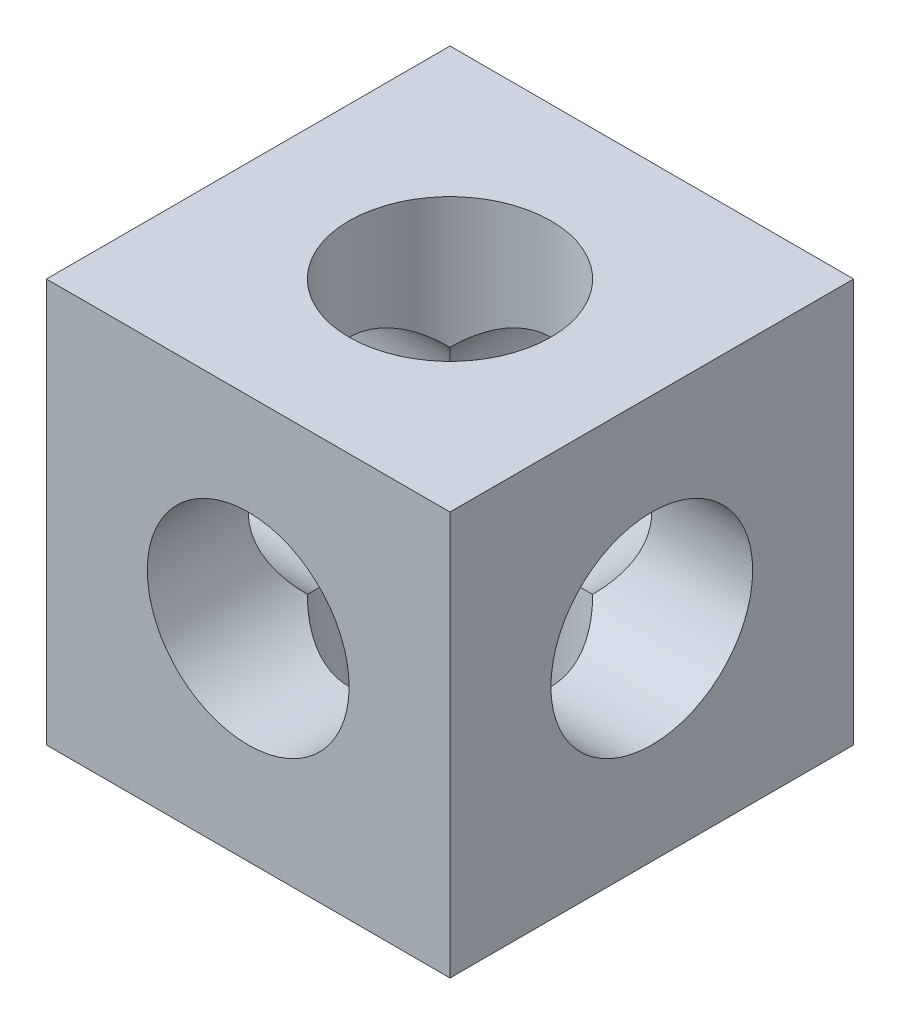
ISO-10303-21;
HEADER;
FILE_DESCRIPTION(('STEP AP214'),'2;1');
FILE_NAME('part.step','',(''),(''),'','','');
FILE_SCHEMA(('AUTOMOTIVE_DESIGN { 1 0 10303 214 1 1 1 1 }'));
ENDSEC;
DATA;
#1=APPLICATION_CONTEXT('core data for automotive mechanical design processes');
#2=APPLICATION_PROTOCOL_DEFINITION('international standard','automotive_design',2000,#1);
#3=PRODUCT_CONTEXT('',#1,'mechanical');
#4=PRODUCT('Part','Part','',(#3));
#5=PRODUCT_RELATED_PRODUCT_CATEGORY('part','',(#4));
#6=PRODUCT_DEFINITION_FORMATION('','',#4);
#7=PRODUCT_DEFINITION_CONTEXT('part definition',#1,'design');
#8=PRODUCT_DEFINITION('design','',#6,#7);
#9=PRODUCT_DEFINITION_SHAPE('','',#8);
#10=(LENGTH_UNIT() NAMED_UNIT(*) SI_UNIT(.MILLI.,.METRE.));
#11=(NAMED_UNIT(*) PLANE_ANGLE_UNIT() SI_UNIT($,.RADIAN.));
#12=(NAMED_UNIT(*) SI_UNIT($,.STERADIAN.) SOLID_ANGLE_UNIT());
#13=UNCERTAINTY_MEASURE_WITH_UNIT(LENGTH_MEASURE(1.E-05),#10,'distance_accuracy_value','');
#14=(GEOMETRIC_REPRESENTATION_CONTEXT(3) GLOBAL_UNCERTAINTY_ASSIGNED_CONTEXT((#13)) GLOBAL_UNIT_ASSIGNED_CONTEXT((#10,
#11,#12)) REPRESENTATION_CONTEXT('',''));
#15=CARTESIAN_POINT('',(0.,0.,0.));
#16=DIRECTION('',(0.,0.,1.));
#17=DIRECTION('',(1.,0.,0.));
#18=AXIS2_PLACEMENT_3D('',#15,#16,#17);
#19=CARTESIAN_POINT('',(25.4,25.4,0.));
#20=DIRECTION('',(0.,0.,1.));
#21=DIRECTION('',(1.,0.,0.));
#22=AXIS2_PLACEMENT_3D('',#19,#20,#21);
#23=CYLINDRICAL_SURFACE('',#22,12.7);
#24=CARTESIAN_POINT('',(25.4,25.4,50.8));
#25=DIRECTION('',(0.,0.,1.));
#26=DIRECTION('',(1.,0.,0.));
#27=AXIS2_PLACEMENT_3D('',#24,#25,#26);
#28=CIRCLE('',#27,12.7);
#29=CARTESIAN_POINT('',(38.1,25.4,50.8));
#30=VERTEX_POINT('',#29);
#31=EDGE_CURVE('E150',#30,#30,#28,.T.);
#32=ORIENTED_EDGE('',*,*,#31,.T.);
#33=EDGE_LOOP('',(#32));
#34=FACE_BOUND('',#33,.T.);
#35=CARTESIAN_POINT('',(25.4,25.4,25.4));
#36=DIRECTION('',(0.,-0.707106781186547,0.707106781186547));
#37=DIRECTION('',(0.,0.707106781186547,0.707106781186547));
#38=AXIS2_PLACEMENT_3D('',#35,#36,#37);
#39=ELLIPSE('',#38,17.9605122421383,12.7);
#40=CARTESIAN_POINT('',(16.4197438789308,34.3802561210692,34.3802561210692));
#41=VERTEX_POINT('',#40);
#42=CARTESIAN_POINT('',(34.3802561210692,34.3802561210692,34.3802561210692));
#43=VERTEX_POINT('',#42);
#44=EDGE_CURVE('E107',#41,#43,#39,.F.);
#45=ORIENTED_EDGE('',*,*,#44,.T.);
#46=CARTESIAN_POINT('',(25.4,25.4,25.4));
#47=DIRECTION('',(-0.707106781186547,0.,0.707106781186547));
#48=DIRECTION('',(0.707106781186547,0.,0.707106781186547));
#49=AXIS2_PLACEMENT_3D('',#46,#47,#48);
#50=ELLIPSE('',#49,17.9605122421383,12.7);
#51=CARTESIAN_POINT('',(34.3802561210692,16.4197438789308,34.3802561210692));
#52=VERTEX_POINT('',#51);
#53=EDGE_CURVE('E96',#43,#52,#50,.F.);
#54=ORIENTED_EDGE('',*,*,#53,.T.);
#55=CARTESIAN_POINT('',(25.4,25.4,25.4));
#56=DIRECTION('',(0.,0.707106781186547,0.707106781186547));
#57=DIRECTION('',(0.,-0.707106781186547,0.707106781186547));
#58=AXIS2_PLACEMENT_3D('',#55,#56,#57);
#59=ELLIPSE('',#58,17.9605122421383,12.7);
#60=CARTESIAN_POINT('',(16.4197438789308,16.4197438789308,34.3802561210692));
#61=VERTEX_POINT('',#60);
#62=EDGE_CURVE('E102',#52,#61,#59,.F.);
#63=ORIENTED_EDGE('',*,*,#62,.T.);
#64=CARTESIAN_POINT('',(25.4,25.4,25.4));
#65=DIRECTION('',(0.707106781186547,0.,0.707106781186547));
#66=DIRECTION('',(-0.707106781186547,0.,0.707106781186547));
#67=AXIS2_PLACEMENT_3D('',#64,#65,#66);
#68=ELLIPSE('',#67,17.9605122421383,12.7);
#69=EDGE_CURVE('E48',#61,#41,#68,.F.);
#70=ORIENTED_EDGE('',*,*,#69,.T.);
#71=EDGE_LOOP('',(#45,#54,#63,#70));
#72=FACE_BOUND('',#71,.T.);
#73=ADVANCED_FACE('F33',(#34,#72),#23,.F.);
#74=CARTESIAN_POINT('',(0.,0.,50.8));
#75=DIRECTION('',(1.,0.,0.));
#76=DIRECTION('',(0.,0.,-1.));
#77=AXIS2_PLACEMENT_3D('',#74,#75,#76);
#78=PLANE('',#77);
#79=CARTESIAN_POINT('',(0.,25.4,25.4));
#80=DIRECTION('',(-1.,0.,0.));
#81=DIRECTION('',(0.,0.,1.));
#82=AXIS2_PLACEMENT_3D('',#79,#80,#81);
#83=CIRCLE('',#82,12.7);
#84=CARTESIAN_POINT('',(0.,25.4,38.1));
#85=VERTEX_POINT('',#84);
#86=EDGE_CURVE('E171',#85,#85,#83,.T.);
#87=ORIENTED_EDGE('',*,*,#86,.F.);
#88=EDGE_LOOP('',(#87));
#89=FACE_BOUND('',#88,.T.);
#90=DIRECTION('',(0.,-1.,0.));
#91=VECTOR('',#90,1.);
#92=CARTESIAN_POINT('',(0.,0.,0.));
#93=LINE('',#92,#91);
#94=CARTESIAN_POINT('',(0.,50.8,0.));
#95=VERTEX_POINT('',#94);
#96=CARTESIAN_POINT('',(0.,0.,0.));
#97=VERTEX_POINT('',#96);
#98=EDGE_CURVE('E139',#95,#97,#93,.T.);
#99=ORIENTED_EDGE('',*,*,#98,.T.);
#100=DIRECTION('',(0.,0.,-1.));
#101=VECTOR('',#100,1.);
#102=CARTESIAN_POINT('',(0.,0.,50.8));
#103=LINE('',#102,#101);
#104=CARTESIAN_POINT('',(0.,0.,50.8));
#105=VERTEX_POINT('',#104);
#106=EDGE_CURVE('E119',#105,#97,#103,.T.);
#107=ORIENTED_EDGE('',*,*,#106,.F.);
#108=DIRECTION('',(0.,-1.,0.));
#109=VECTOR('',#108,1.);
#110=CARTESIAN_POINT('',(0.,0.,50.8));
#111=LINE('',#110,#109);
#112=CARTESIAN_POINT('',(0.,50.8,50.8));
#113=VERTEX_POINT('',#112);
#114=EDGE_CURVE('E134',#113,#105,#111,.T.);
#115=ORIENTED_EDGE('',*,*,#114,.F.);
#116=DIRECTION('',(0.,0.,-1.));
#117=VECTOR('',#116,1.);
#118=CARTESIAN_POINT('',(0.,50.8,50.8));
#119=LINE('',#118,#117);
#120=EDGE_CURVE('E128',#113,#95,#119,.T.);
#121=ORIENTED_EDGE('',*,*,#120,.T.);
#122=EDGE_LOOP('',(#99,#107,#115,#121));
#123=FACE_BOUND('',#122,.T.);
#124=ADVANCED_FACE('F35',(#89,#123),#78,.F.);
#125=CARTESIAN_POINT('',(0.,0.,50.8));
#126=DIRECTION('',(0.,1.,0.));
#127=DIRECTION('',(0.,0.,1.));
#128=AXIS2_PLACEMENT_3D('',#125,#126,#127);
#129=PLANE('',#128);
#130=CARTESIAN_POINT('',(25.4,0.,25.4));
#131=DIRECTION('',(0.,1.,0.));
#132=DIRECTION('',(0.,0.,1.));
#133=AXIS2_PLACEMENT_3D('',#130,#131,#132);
#134=CIRCLE('',#133,12.7);
#135=CARTESIAN_POINT('',(25.4,0.,38.1));
#136=VERTEX_POINT('',#135);
#137=EDGE_CURVE('E153',#136,#136,#134,.T.);
#138=ORIENTED_EDGE('',*,*,#137,.T.);
#139=EDGE_LOOP('',(#138));
#140=FACE_BOUND('',#139,.T.);
#141=DIRECTION('',(1.,0.,0.));
#142=VECTOR('',#141,1.);
#143=CARTESIAN_POINT('',(0.,0.,0.));
#144=LINE('',#143,#142);
#145=CARTESIAN_POINT('',(50.8,0.,0.));
#146=VERTEX_POINT('',#145);
#147=EDGE_CURVE('E137',#97,#146,#144,.T.);
#148=ORIENTED_EDGE('',*,*,#147,.T.);
#149=DIRECTION('',(0.,0.,-1.));
#150=VECTOR('',#149,1.);
#151=CARTESIAN_POINT('',(50.8,0.,50.8));
#152=LINE('',#151,#150);
#153=CARTESIAN_POINT('',(50.8,0.,50.8));
#154=VERTEX_POINT('',#153);
#155=EDGE_CURVE('E122',#154,#146,#152,.T.);
#156=ORIENTED_EDGE('',*,*,#155,.F.);
#157=DIRECTION('',(1.,0.,0.));
#158=VECTOR('',#157,1.);
#159=CARTESIAN_POINT('',(0.,0.,50.8));
#160=LINE('',#159,#158);
#161=EDGE_CURVE('E146',#105,#154,#160,.T.);
#162=ORIENTED_EDGE('',*,*,#161,.F.);
#163=ORIENTED_EDGE('',*,*,#106,.T.);
#164=EDGE_LOOP('',(#148,#156,#162,#163));
#165=FACE_BOUND('',#164,.T.);
#166=ADVANCED_FACE('F198',(#140,#165),#129,.F.);
#167=CARTESIAN_POINT('',(50.8,0.,50.8));
#168=DIRECTION('',(-1.,0.,0.));
#169=DIRECTION('',(0.,0.,1.));
#170=AXIS2_PLACEMENT_3D('',#167,#168,#169);
#171=PLANE('',#170);
#172=CARTESIAN_POINT('',(50.8,25.4,25.4));
#173=DIRECTION('',(-1.,0.,0.));
#174=DIRECTION('',(0.,0.,1.));
#175=AXIS2_PLACEMENT_3D('',#172,#173,#174);
#176=CIRCLE('',#175,12.7);
#177=CARTESIAN_POINT('',(50.8,25.4,38.1));
#178=VERTEX_POINT('',#177);
#179=EDGE_CURVE('E170',#178,#178,#176,.T.);
#180=ORIENTED_EDGE('',*,*,#179,.T.);
#181=EDGE_LOOP('',(#180));
#182=FACE_BOUND('',#181,.T.);
#183=DIRECTION('',(0.,1.,0.));
#184=VECTOR('',#183,1.);
#185=CARTESIAN_POINT('',(50.8,0.,0.));
#186=LINE('',#185,#184);
#187=CARTESIAN_POINT('',(50.8,50.8,0.));
#188=VERTEX_POINT('',#187);
#189=EDGE_CURVE('E135',#146,#188,#186,.T.);
#190=ORIENTED_EDGE('',*,*,#189,.T.);
#191=DIRECTION('',(0.,0.,-1.));
#192=VECTOR('',#191,1.);
#193=CARTESIAN_POINT('',(50.8,50.8,50.8));
#194=LINE('',#193,#192);
#195=CARTESIAN_POINT('',(50.8,50.8,50.8));
#196=VERTEX_POINT('',#195);
#197=EDGE_CURVE('E125',#196,#188,#194,.T.);
#198=ORIENTED_EDGE('',*,*,#197,.F.);
#199=DIRECTION('',(0.,1.,0.));
#200=VECTOR('',#199,1.);
#201=CARTESIAN_POINT('',(50.8,0.,50.8));
#202=LINE('',#201,#200);
#203=EDGE_CURVE('E144',#154,#196,#202,.T.);
#204=ORIENTED_EDGE('',*,*,#203,.F.);
#205=ORIENTED_EDGE('',*,*,#155,.T.);
#206=EDGE_LOOP('',(#190,#198,#204,#205));
#207=FACE_BOUND('',#206,.T.);
#208=ADVANCED_FACE('F177',(#182,#207),#171,.F.);
#209=CARTESIAN_POINT('',(0.,50.8,50.8));
#210=DIRECTION('',(0.,-1.,0.));
#211=DIRECTION('',(0.,0.,-1.));
#212=AXIS2_PLACEMENT_3D('',#209,#210,#211);
#213=PLANE('',#212);
#214=CARTESIAN_POINT('',(25.4,50.8,25.4));
#215=DIRECTION('',(0.,1.,0.));
#216=DIRECTION('',(0.,0.,1.));
#217=AXIS2_PLACEMENT_3D('',#214,#215,#216);
#218=CIRCLE('',#217,12.7);
#219=CARTESIAN_POINT('',(25.4,50.8,38.1));
#220=VERTEX_POINT('',#219);
#221=EDGE_CURVE('E156',#220,#220,#218,.T.);
#222=ORIENTED_EDGE('',*,*,#221,.F.);
#223=EDGE_LOOP('',(#222));
#224=FACE_BOUND('',#223,.T.);
#225=DIRECTION('',(-1.,0.,0.));
#226=VECTOR('',#225,1.);
#227=CARTESIAN_POINT('',(0.,50.8,0.));
#228=LINE('',#227,#226);
#229=EDGE_CURVE('E132',#188,#95,#228,.T.);
#230=ORIENTED_EDGE('',*,*,#229,.T.);
#231=ORIENTED_EDGE('',*,*,#120,.F.);
#232=DIRECTION('',(-1.,0.,0.));
#233=VECTOR('',#232,1.);
#234=CARTESIAN_POINT('',(0.,50.8,50.8));
#235=LINE('',#234,#233);
#236=EDGE_CURVE('E131',#196,#113,#235,.T.);
#237=ORIENTED_EDGE('',*,*,#236,.F.);
#238=ORIENTED_EDGE('',*,*,#197,.T.);
#239=EDGE_LOOP('',(#230,#231,#237,#238));
#240=FACE_BOUND('',#239,.T.);
#241=ADVANCED_FACE('F225',(#224,#240),#213,.F.);
#242=CARTESIAN_POINT('',(0.,0.,50.8));
#243=DIRECTION('',(0.,0.,-1.));
#244=DIRECTION('',(-1.,0.,0.));
#245=AXIS2_PLACEMENT_3D('',#242,#243,#244);
#246=PLANE('',#245);
#247=ORIENTED_EDGE('',*,*,#31,.F.);
#248=EDGE_LOOP('',(#247));
#249=FACE_BOUND('',#248,.T.);
#250=ORIENTED_EDGE('',*,*,#114,.T.);
#251=ORIENTED_EDGE('',*,*,#161,.T.);
#252=ORIENTED_EDGE('',*,*,#203,.T.);
#253=ORIENTED_EDGE('',*,*,#236,.T.);
#254=EDGE_LOOP('',(#250,#251,#252,#253));
#255=FACE_BOUND('',#254,.T.);
#256=ADVANCED_FACE('F209',(#249,#255),#246,.F.);
#257=CARTESIAN_POINT('',(0.,0.,0.));
#258=DIRECTION('',(0.,0.,-1.));
#259=DIRECTION('',(-1.,0.,0.));
#260=AXIS2_PLACEMENT_3D('',#257,#258,#259);
#261=PLANE('',#260);
#262=CARTESIAN_POINT('',(25.4,25.4,0.));
#263=DIRECTION('',(0.,0.,1.));
#264=DIRECTION('',(1.,0.,0.));
#265=AXIS2_PLACEMENT_3D('',#262,#263,#264);
#266=CIRCLE('',#265,12.7);
#267=CARTESIAN_POINT('',(38.1,25.4,0.));
#268=VERTEX_POINT('',#267);
#269=EDGE_CURVE('E142',#268,#268,#266,.T.);
#270=ORIENTED_EDGE('',*,*,#269,.T.);
#271=EDGE_LOOP('',(#270));
#272=FACE_BOUND('',#271,.T.);
#273=ORIENTED_EDGE('',*,*,#98,.F.);
#274=ORIENTED_EDGE('',*,*,#229,.F.);
#275=ORIENTED_EDGE('',*,*,#189,.F.);
#276=ORIENTED_EDGE('',*,*,#147,.F.);
#277=EDGE_LOOP('',(#273,#274,#275,#276));
#278=FACE_BOUND('',#277,.T.);
#279=ADVANCED_FACE('F202',(#272,#278),#261,.T.);
#280=CARTESIAN_POINT('',(25.4,25.4,25.4));
#281=DIRECTION('',(0.,0.707106781186547,0.707106781186547));
#282=DIRECTION('',(0.,-0.707106781186547,0.707106781186547));
#283=AXIS2_PLACEMENT_3D('',#280,#281,#282);
#284=ELLIPSE('',#283,17.9605122421383,12.7);
#285=CARTESIAN_POINT('',(34.3802561210692,34.3802561210692,16.4197438789308));
#286=VERTEX_POINT('',#285);
#287=CARTESIAN_POINT('',(16.4197438789308,34.3802561210692,16.4197438789308));
#288=VERTEX_POINT('',#287);
#289=EDGE_CURVE('E111',#286,#288,#284,.T.);
#290=ORIENTED_EDGE('',*,*,#289,.T.);
#291=CARTESIAN_POINT('',(25.4,25.4,25.4));
#292=DIRECTION('',(-0.707106781186547,0.,0.707106781186547));
#293=DIRECTION('',(0.707106781186547,0.,0.707106781186547));
#294=AXIS2_PLACEMENT_3D('',#291,#292,#293);
#295=ELLIPSE('',#294,17.9605122421383,12.7);
#296=CARTESIAN_POINT('',(16.4197438789308,16.4197438789308,16.4197438789309));
#297=VERTEX_POINT('',#296);
#298=EDGE_CURVE('E165',#288,#297,#295,.T.);
#299=ORIENTED_EDGE('',*,*,#298,.T.);
#300=CARTESIAN_POINT('',(25.4,25.4,25.4));
#301=DIRECTION('',(0.,-0.707106781186547,0.707106781186547));
#302=DIRECTION('',(0.,0.707106781186547,0.707106781186547));
#303=AXIS2_PLACEMENT_3D('',#300,#301,#302);
#304=ELLIPSE('',#303,17.9605122421383,12.7);
#305=CARTESIAN_POINT('',(34.3802561210692,16.4197438789308,16.4197438789309));
#306=VERTEX_POINT('',#305);
#307=EDGE_CURVE('E114',#297,#306,#304,.T.);
#308=ORIENTED_EDGE('',*,*,#307,.T.);
#309=CARTESIAN_POINT('',(25.4,25.4,25.4));
#310=DIRECTION('',(0.707106781186547,0.,0.707106781186547));
#311=DIRECTION('',(-0.707106781186547,0.,0.707106781186547));
#312=AXIS2_PLACEMENT_3D('',#309,#310,#311);
#313=ELLIPSE('',#312,17.9605122421383,12.7);
#314=EDGE_CURVE('E55',#306,#286,#313,.T.);
#315=ORIENTED_EDGE('',*,*,#314,.T.);
#316=EDGE_LOOP('',(#290,#299,#308,#315));
#317=FACE_BOUND('',#316,.T.);
#318=ORIENTED_EDGE('',*,*,#269,.F.);
#319=EDGE_LOOP('',(#318));
#320=FACE_BOUND('',#319,.T.);
#321=ADVANCED_FACE('F194',(#317,#320),#23,.F.);
#322=CARTESIAN_POINT('',(25.4,0.,25.4));
#323=DIRECTION('',(0.,1.,0.));
#324=DIRECTION('',(0.,0.,1.));
#325=AXIS2_PLACEMENT_3D('',#322,#323,#324);
#326=CYLINDRICAL_SURFACE('',#325,12.7);
#327=ORIENTED_EDGE('',*,*,#221,.T.);
#328=EDGE_LOOP('',(#327));
#329=FACE_BOUND('',#328,.T.);
#330=ORIENTED_EDGE('',*,*,#289,.F.);
#331=CARTESIAN_POINT('',(25.4,25.4,25.4));
#332=DIRECTION('',(-0.707106781186547,0.707106781186547,0.));
#333=DIRECTION('',(0.707106781186547,0.707106781186547,0.));
#334=AXIS2_PLACEMENT_3D('',#331,#332,#333);
#335=ELLIPSE('',#334,17.9605122421383,12.7);
#336=EDGE_CURVE('E108',#286,#43,#335,.F.);
#337=ORIENTED_EDGE('',*,*,#336,.T.);
#338=ORIENTED_EDGE('',*,*,#44,.F.);
#339=CARTESIAN_POINT('',(25.4,25.4,25.4));
#340=DIRECTION('',(0.707106781186547,0.707106781186547,0.));
#341=DIRECTION('',(-0.707106781186547,0.707106781186547,0.));
#342=AXIS2_PLACEMENT_3D('',#339,#340,#341);
#343=ELLIPSE('',#342,17.9605122421383,12.7);
#344=EDGE_CURVE('E159',#41,#288,#343,.F.);
#345=ORIENTED_EDGE('',*,*,#344,.T.);
#346=EDGE_LOOP('',(#330,#337,#338,#345));
#347=FACE_BOUND('',#346,.T.);
#348=ADVANCED_FACE('F188',(#329,#347),#326,.F.);
#349=ORIENTED_EDGE('',*,*,#137,.F.);
#350=EDGE_LOOP('',(#349));
#351=FACE_BOUND('',#350,.T.);
#352=ORIENTED_EDGE('',*,*,#307,.F.);
#353=CARTESIAN_POINT('',(25.4,25.4,25.4));
#354=DIRECTION('',(-0.707106781186547,0.707106781186547,0.));
#355=DIRECTION('',(0.707106781186547,0.707106781186547,0.));
#356=AXIS2_PLACEMENT_3D('',#353,#354,#355);
#357=ELLIPSE('',#356,17.9605122421383,12.7);
#358=EDGE_CURVE('E11',#297,#61,#357,.T.);
#359=ORIENTED_EDGE('',*,*,#358,.T.);
#360=ORIENTED_EDGE('',*,*,#62,.F.);
#361=CARTESIAN_POINT('',(25.4,25.4,25.4));
#362=DIRECTION('',(0.707106781186547,0.707106781186547,0.));
#363=DIRECTION('',(-0.707106781186547,0.707106781186547,0.));
#364=AXIS2_PLACEMENT_3D('',#361,#362,#363);
#365=ELLIPSE('',#364,17.9605122421383,12.7);
#366=EDGE_CURVE('E41',#52,#306,#365,.T.);
#367=ORIENTED_EDGE('',*,*,#366,.T.);
#368=EDGE_LOOP('',(#352,#359,#360,#367));
#369=FACE_BOUND('',#368,.T.);
#370=ADVANCED_FACE('F110',(#351,#369),#326,.F.);
#371=CARTESIAN_POINT('',(50.8,25.4,25.4));
#372=DIRECTION('',(-1.,0.,0.));
#373=DIRECTION('',(0.,0.,1.));
#374=AXIS2_PLACEMENT_3D('',#371,#372,#373);
#375=CYLINDRICAL_SURFACE('',#374,12.7);
#376=ORIENTED_EDGE('',*,*,#179,.F.);
#377=EDGE_LOOP('',(#376));
#378=FACE_BOUND('',#377,.T.);
#379=ORIENTED_EDGE('',*,*,#314,.F.);
#380=ORIENTED_EDGE('',*,*,#366,.F.);
#381=ORIENTED_EDGE('',*,*,#53,.F.);
#382=ORIENTED_EDGE('',*,*,#336,.F.);
#383=EDGE_LOOP('',(#379,#380,#381,#382));
#384=FACE_BOUND('',#383,.T.);
#385=ADVANCED_FACE('F95',(#378,#384),#375,.F.);
#386=ORIENTED_EDGE('',*,*,#86,.T.);
#387=EDGE_LOOP('',(#386));
#388=FACE_BOUND('',#387,.T.);
#389=ORIENTED_EDGE('',*,*,#69,.F.);
#390=ORIENTED_EDGE('',*,*,#358,.F.);
#391=ORIENTED_EDGE('',*,*,#298,.F.);
#392=ORIENTED_EDGE('',*,*,#344,.F.);
#393=EDGE_LOOP('',(#389,#390,#391,#392));
#394=FACE_BOUND('',#393,.T.);
#395=ADVANCED_FACE('F181',(#388,#394),#375,.F.);
#396=CLOSED_SHELL('',(#73,#124,#166,#208,#241,#256,#279,#321,#348,#370,#385,#395));
#397=MANIFOLD_SOLID_BREP('B2',#396);
#398=ADVANCED_BREP_SHAPE_REPRESENTATION('',(#18,#397),#14);
#399=SHAPE_DEFINITION_REPRESENTATION(#9,#398);
ENDSEC;
END-ISO-10303-21;
